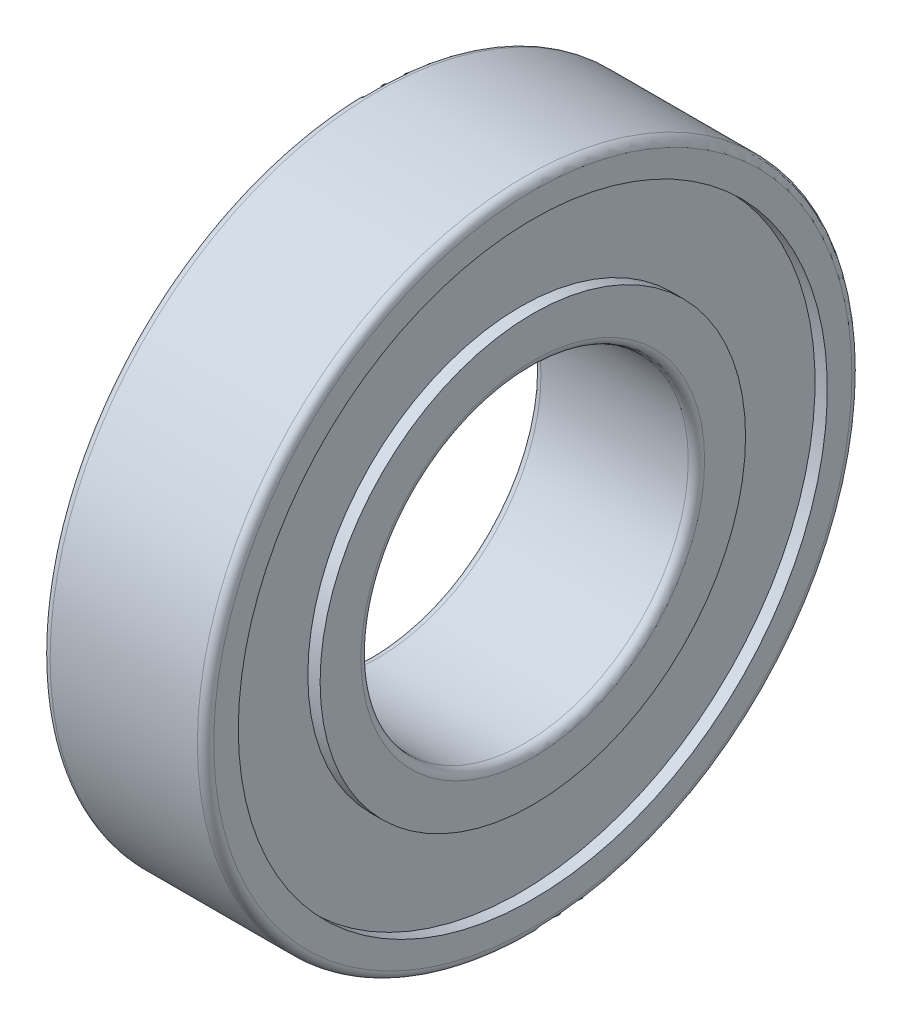
ISO-10303-21;
HEADER;
FILE_DESCRIPTION(('STEP AP214'),'2;1');
FILE_NAME('part.step','',(''),(''),'','','');
FILE_SCHEMA(('AUTOMOTIVE_DESIGN { 1 0 10303 214 1 1 1 1 }'));
ENDSEC;
DATA;
#1=APPLICATION_CONTEXT('core data for automotive mechanical design processes');
#2=APPLICATION_PROTOCOL_DEFINITION('international standard','automotive_design',2000,#1);
#3=PRODUCT_CONTEXT('',#1,'mechanical');
#4=PRODUCT('Part','Part','',(#3));
#5=PRODUCT_RELATED_PRODUCT_CATEGORY('part','',(#4));
#6=PRODUCT_DEFINITION_FORMATION('','',#4);
#7=PRODUCT_DEFINITION_CONTEXT('part definition',#1,'design');
#8=PRODUCT_DEFINITION('design','',#6,#7);
#9=PRODUCT_DEFINITION_SHAPE('','',#8);
#10=(LENGTH_UNIT() NAMED_UNIT(*) SI_UNIT(.MILLI.,.METRE.));
#11=(NAMED_UNIT(*) PLANE_ANGLE_UNIT() SI_UNIT($,.RADIAN.));
#12=(NAMED_UNIT(*) SI_UNIT($,.STERADIAN.) SOLID_ANGLE_UNIT());
#13=UNCERTAINTY_MEASURE_WITH_UNIT(LENGTH_MEASURE(1.E-05),#10,'distance_accuracy_value','');
#14=(GEOMETRIC_REPRESENTATION_CONTEXT(3) GLOBAL_UNCERTAINTY_ASSIGNED_CONTEXT((#13)) GLOBAL_UNIT_ASSIGNED_CONTEXT((#10,
#11,#12)) REPRESENTATION_CONTEXT('',''));
#15=CARTESIAN_POINT('',(0.,0.,0.));
#16=DIRECTION('',(0.,0.,1.));
#17=DIRECTION('',(1.,0.,0.));
#18=AXIS2_PLACEMENT_3D('',#15,#16,#17);
#19=CARTESIAN_POINT('',(6.,0.,0.));
#20=DIRECTION('',(-1.,0.,0.));
#21=DIRECTION('',(0.,0.,1.));
#22=AXIS2_PLACEMENT_3D('',#19,#20,#21);
#23=CYLINDRICAL_SURFACE('',#22,6.);
#24=CARTESIAN_POINT('',(0.3,0.,0.));
#25=DIRECTION('',(1.,0.,0.));
#26=DIRECTION('',(0.,0.,-1.));
#27=AXIS2_PLACEMENT_3D('',#24,#25,#26);
#28=CIRCLE('',#27,6.);
#29=CARTESIAN_POINT('',(0.3,0.,-6.));
#30=VERTEX_POINT('',#29);
#31=EDGE_CURVE('E160',#30,#30,#28,.T.);
#32=ORIENTED_EDGE('',*,*,#31,.F.);
#33=EDGE_LOOP('',(#32));
#34=FACE_BOUND('',#33,.T.);
#35=CARTESIAN_POINT('',(5.7,0.,0.));
#36=DIRECTION('',(1.,0.,0.));
#37=DIRECTION('',(0.,0.,-1.));
#38=AXIS2_PLACEMENT_3D('',#35,#36,#37);
#39=CIRCLE('',#38,6.);
#40=CARTESIAN_POINT('',(5.7,0.,-6.));
#41=VERTEX_POINT('',#40);
#42=EDGE_CURVE('E139',#41,#41,#39,.F.);
#43=ORIENTED_EDGE('',*,*,#42,.F.);
#44=EDGE_LOOP('',(#43));
#45=FACE_BOUND('',#44,.T.);
#46=ADVANCED_FACE('F14',(#34,#45),#23,.F.);
#47=CARTESIAN_POINT('',(0.300000000000002,0.,0.));
#48=DIRECTION('',(1.,0.,0.));
#49=DIRECTION('',(0.,0.,-1.));
#50=AXIS2_PLACEMENT_3D('',#47,#48,#49);
#51=TOROIDAL_SURFACE('',#50,6.3,0.3);
#52=CARTESIAN_POINT('',(0.,0.,0.));
#53=DIRECTION('',(-1.,0.,0.));
#54=DIRECTION('',(0.,0.,-1.));
#55=AXIS2_PLACEMENT_3D('',#52,#53,#54);
#56=CIRCLE('',#55,6.3);
#57=CARTESIAN_POINT('',(0.,0.,-6.3));
#58=VERTEX_POINT('',#57);
#59=EDGE_CURVE('E128',#58,#58,#56,.F.);
#60=ORIENTED_EDGE('',*,*,#59,.F.);
#61=EDGE_LOOP('',(#60));
#62=FACE_BOUND('',#61,.T.);
#63=ORIENTED_EDGE('',*,*,#31,.T.);
#64=EDGE_LOOP('',(#63));
#65=FACE_BOUND('',#64,.T.);
#66=ADVANCED_FACE('F144',(#62,#65),#51,.T.);
#67=CARTESIAN_POINT('',(5.7,0.,0.));
#68=DIRECTION('',(1.,0.,0.));
#69=DIRECTION('',(0.,0.,-1.));
#70=AXIS2_PLACEMENT_3D('',#67,#68,#69);
#71=TOROIDAL_SURFACE('',#70,6.3,0.3);
#72=ORIENTED_EDGE('',*,*,#42,.T.);
#73=EDGE_LOOP('',(#72));
#74=FACE_BOUND('',#73,.T.);
#75=CARTESIAN_POINT('',(6.,0.,0.));
#76=DIRECTION('',(1.,0.,0.));
#77=DIRECTION('',(0.,0.,-1.));
#78=AXIS2_PLACEMENT_3D('',#75,#76,#77);
#79=CIRCLE('',#78,6.3);
#80=CARTESIAN_POINT('',(6.,0.,-6.3));
#81=VERTEX_POINT('',#80);
#82=EDGE_CURVE('E196',#81,#81,#79,.F.);
#83=ORIENTED_EDGE('',*,*,#82,.F.);
#84=EDGE_LOOP('',(#83));
#85=FACE_BOUND('',#84,.T.);
#86=ADVANCED_FACE('F141',(#74,#85),#71,.T.);
#87=CARTESIAN_POINT('',(0.,7.8,0.));
#88=DIRECTION('',(-1.,0.,0.));
#89=DIRECTION('',(0.,0.,1.));
#90=AXIS2_PLACEMENT_3D('',#87,#88,#89);
#91=PLANE('',#90);
#92=CARTESIAN_POINT('',(0.,0.,0.));
#93=DIRECTION('',(-1.,0.,0.));
#94=DIRECTION('',(0.,0.,1.));
#95=AXIS2_PLACEMENT_3D('',#92,#93,#94);
#96=CIRCLE('',#95,7.8);
#97=CARTESIAN_POINT('',(0.,0.,7.8));
#98=VERTEX_POINT('',#97);
#99=EDGE_CURVE('E17',#98,#98,#96,.F.);
#100=ORIENTED_EDGE('',*,*,#99,.F.);
#101=EDGE_LOOP('',(#100));
#102=FACE_BOUND('',#101,.T.);
#103=ORIENTED_EDGE('',*,*,#59,.T.);
#104=EDGE_LOOP('',(#103));
#105=FACE_BOUND('',#104,.T.);
#106=ADVANCED_FACE('F109',(#102,#105),#91,.T.);
#107=CARTESIAN_POINT('',(6.,6.3,0.));
#108=DIRECTION('',(1.,0.,0.));
#109=DIRECTION('',(0.,0.,-1.));
#110=AXIS2_PLACEMENT_3D('',#107,#108,#109);
#111=PLANE('',#110);
#112=ORIENTED_EDGE('',*,*,#82,.T.);
#113=EDGE_LOOP('',(#112));
#114=FACE_BOUND('',#113,.T.);
#115=CARTESIAN_POINT('',(6.,0.,0.));
#116=DIRECTION('',(-1.,0.,0.));
#117=DIRECTION('',(0.,0.,1.));
#118=AXIS2_PLACEMENT_3D('',#115,#116,#117);
#119=CIRCLE('',#118,7.8);
#120=CARTESIAN_POINT('',(6.,0.,7.8));
#121=VERTEX_POINT('',#120);
#122=EDGE_CURVE('E192',#121,#121,#119,.T.);
#123=ORIENTED_EDGE('',*,*,#122,.F.);
#124=EDGE_LOOP('',(#123));
#125=FACE_BOUND('',#124,.T.);
#126=ADVANCED_FACE('F104',(#114,#125),#111,.T.);
#127=CARTESIAN_POINT('',(6.,0.,0.));
#128=DIRECTION('',(-1.,0.,0.));
#129=DIRECTION('',(0.,0.,1.));
#130=AXIS2_PLACEMENT_3D('',#127,#128,#129);
#131=CYLINDRICAL_SURFACE('',#130,7.8);
#132=CARTESIAN_POINT('',(0.45,0.,0.));
#133=DIRECTION('',(-1.,0.,0.));
#134=DIRECTION('',(0.,0.,1.));
#135=AXIS2_PLACEMENT_3D('',#132,#133,#134);
#136=CIRCLE('',#135,7.8);
#137=CARTESIAN_POINT('',(0.45,0.,7.8));
#138=VERTEX_POINT('',#137);
#139=EDGE_CURVE('E190',#138,#138,#136,.F.);
#140=ORIENTED_EDGE('',*,*,#139,.F.);
#141=EDGE_LOOP('',(#140));
#142=FACE_BOUND('',#141,.T.);
#143=ORIENTED_EDGE('',*,*,#99,.T.);
#144=EDGE_LOOP('',(#143));
#145=FACE_BOUND('',#144,.T.);
#146=ADVANCED_FACE('F100',(#142,#145),#131,.T.);
#147=CARTESIAN_POINT('',(6.,0.,0.));
#148=DIRECTION('',(-1.,0.,0.));
#149=DIRECTION('',(0.,0.,1.));
#150=AXIS2_PLACEMENT_3D('',#147,#148,#149);
#151=CYLINDRICAL_SURFACE('',#150,7.8);
#152=ORIENTED_EDGE('',*,*,#122,.T.);
#153=EDGE_LOOP('',(#152));
#154=FACE_BOUND('',#153,.T.);
#155=CARTESIAN_POINT('',(5.55,0.,0.));
#156=DIRECTION('',(-1.,0.,0.));
#157=DIRECTION('',(0.,0.,1.));
#158=AXIS2_PLACEMENT_3D('',#155,#156,#157);
#159=CIRCLE('',#158,7.8);
#160=CARTESIAN_POINT('',(5.55,0.,7.8));
#161=VERTEX_POINT('',#160);
#162=EDGE_CURVE('E187',#161,#161,#159,.T.);
#163=ORIENTED_EDGE('',*,*,#162,.F.);
#164=EDGE_LOOP('',(#163));
#165=FACE_BOUND('',#164,.T.);
#166=ADVANCED_FACE('F96',(#154,#165),#151,.T.);
#167=CARTESIAN_POINT('',(0.45,10.8,0.));
#168=DIRECTION('',(-1.,0.,0.));
#169=DIRECTION('',(0.,0.,1.));
#170=AXIS2_PLACEMENT_3D('',#167,#168,#169);
#171=PLANE('',#170);
#172=CARTESIAN_POINT('',(0.45,0.,0.));
#173=DIRECTION('',(-1.,0.,0.));
#174=DIRECTION('',(0.,0.,1.));
#175=AXIS2_PLACEMENT_3D('',#172,#173,#174);
#176=CIRCLE('',#175,10.8);
#177=CARTESIAN_POINT('',(0.45,0.,10.8));
#178=VERTEX_POINT('',#177);
#179=EDGE_CURVE('E184',#178,#178,#176,.T.);
#180=ORIENTED_EDGE('',*,*,#179,.T.);
#181=EDGE_LOOP('',(#180));
#182=FACE_BOUND('',#181,.T.);
#183=ORIENTED_EDGE('',*,*,#139,.T.);
#184=EDGE_LOOP('',(#183));
#185=FACE_BOUND('',#184,.T.);
#186=ADVANCED_FACE('F92',(#182,#185),#171,.T.);
#187=CARTESIAN_POINT('',(5.55,7.8,0.));
#188=DIRECTION('',(1.,0.,0.));
#189=DIRECTION('',(0.,0.,-1.));
#190=AXIS2_PLACEMENT_3D('',#187,#188,#189);
#191=PLANE('',#190);
#192=ORIENTED_EDGE('',*,*,#162,.T.);
#193=EDGE_LOOP('',(#192));
#194=FACE_BOUND('',#193,.T.);
#195=CARTESIAN_POINT('',(5.55,0.,0.));
#196=DIRECTION('',(-1.,0.,0.));
#197=DIRECTION('',(0.,0.,1.));
#198=AXIS2_PLACEMENT_3D('',#195,#196,#197);
#199=CIRCLE('',#198,10.8);
#200=CARTESIAN_POINT('',(5.55,0.,10.8));
#201=VERTEX_POINT('',#200);
#202=EDGE_CURVE('E181',#201,#201,#199,.F.);
#203=ORIENTED_EDGE('',*,*,#202,.T.);
#204=EDGE_LOOP('',(#203));
#205=FACE_BOUND('',#204,.T.);
#206=ADVANCED_FACE('F88',(#194,#205),#191,.T.);
#207=CARTESIAN_POINT('',(6.,0.,0.));
#208=DIRECTION('',(-1.,0.,0.));
#209=DIRECTION('',(0.,0.,1.));
#210=AXIS2_PLACEMENT_3D('',#207,#208,#209);
#211=CYLINDRICAL_SURFACE('',#210,10.8);
#212=CARTESIAN_POINT('',(0.,0.,0.));
#213=DIRECTION('',(-1.,0.,0.));
#214=DIRECTION('',(0.,0.,1.));
#215=AXIS2_PLACEMENT_3D('',#212,#213,#214);
#216=CIRCLE('',#215,10.8);
#217=CARTESIAN_POINT('',(0.,0.,10.8));
#218=VERTEX_POINT('',#217);
#219=EDGE_CURVE('E178',#218,#218,#216,.F.);
#220=ORIENTED_EDGE('',*,*,#219,.F.);
#221=EDGE_LOOP('',(#220));
#222=FACE_BOUND('',#221,.T.);
#223=ORIENTED_EDGE('',*,*,#179,.F.);
#224=EDGE_LOOP('',(#223));
#225=FACE_BOUND('',#224,.T.);
#226=ADVANCED_FACE('F84',(#222,#225),#211,.F.);
#227=CARTESIAN_POINT('',(6.,0.,0.));
#228=DIRECTION('',(-1.,0.,0.));
#229=DIRECTION('',(0.,0.,1.));
#230=AXIS2_PLACEMENT_3D('',#227,#228,#229);
#231=CYLINDRICAL_SURFACE('',#230,10.8);
#232=ORIENTED_EDGE('',*,*,#202,.F.);
#233=EDGE_LOOP('',(#232));
#234=FACE_BOUND('',#233,.T.);
#235=CARTESIAN_POINT('',(6.,0.,0.));
#236=DIRECTION('',(-1.,0.,0.));
#237=DIRECTION('',(0.,0.,1.));
#238=AXIS2_PLACEMENT_3D('',#235,#236,#237);
#239=CIRCLE('',#238,10.8);
#240=CARTESIAN_POINT('',(6.,0.,10.8));
#241=VERTEX_POINT('',#240);
#242=EDGE_CURVE('E170',#241,#241,#239,.T.);
#243=ORIENTED_EDGE('',*,*,#242,.F.);
#244=EDGE_LOOP('',(#243));
#245=FACE_BOUND('',#244,.T.);
#246=ADVANCED_FACE('F80',(#234,#245),#231,.F.);
#247=CARTESIAN_POINT('',(0.,11.7,0.));
#248=DIRECTION('',(-1.,0.,0.));
#249=DIRECTION('',(0.,0.,1.));
#250=AXIS2_PLACEMENT_3D('',#247,#248,#249);
#251=PLANE('',#250);
#252=CARTESIAN_POINT('',(0.,0.,0.));
#253=DIRECTION('',(1.,0.,0.));
#254=DIRECTION('',(0.,0.,-1.));
#255=AXIS2_PLACEMENT_3D('',#252,#253,#254);
#256=CIRCLE('',#255,11.7);
#257=CARTESIAN_POINT('',(0.,0.,-11.7));
#258=VERTEX_POINT('',#257);
#259=EDGE_CURVE('E64',#258,#258,#256,.T.);
#260=ORIENTED_EDGE('',*,*,#259,.F.);
#261=EDGE_LOOP('',(#260));
#262=FACE_BOUND('',#261,.T.);
#263=ORIENTED_EDGE('',*,*,#219,.T.);
#264=EDGE_LOOP('',(#263));
#265=FACE_BOUND('',#264,.T.);
#266=ADVANCED_FACE('F70',(#262,#265),#251,.T.);
#267=CARTESIAN_POINT('',(6.,10.8,0.));
#268=DIRECTION('',(1.,0.,0.));
#269=DIRECTION('',(0.,0.,-1.));
#270=AXIS2_PLACEMENT_3D('',#267,#268,#269);
#271=PLANE('',#270);
#272=ORIENTED_EDGE('',*,*,#242,.T.);
#273=EDGE_LOOP('',(#272));
#274=FACE_BOUND('',#273,.T.);
#275=CARTESIAN_POINT('',(6.,0.,0.));
#276=DIRECTION('',(-1.,0.,0.));
#277=DIRECTION('',(0.,0.,-1.));
#278=AXIS2_PLACEMENT_3D('',#275,#276,#277);
#279=CIRCLE('',#278,11.7);
#280=CARTESIAN_POINT('',(6.,0.,-11.7));
#281=VERTEX_POINT('',#280);
#282=EDGE_CURVE('E26',#281,#281,#279,.T.);
#283=ORIENTED_EDGE('',*,*,#282,.F.);
#284=EDGE_LOOP('',(#283));
#285=FACE_BOUND('',#284,.T.);
#286=ADVANCED_FACE('F79',(#274,#285),#271,.T.);
#287=CARTESIAN_POINT('',(0.300000000000002,0.,0.));
#288=DIRECTION('',(1.,0.,0.));
#289=DIRECTION('',(0.,0.,-1.));
#290=AXIS2_PLACEMENT_3D('',#287,#288,#289);
#291=TOROIDAL_SURFACE('',#290,11.7,0.3);
#292=CARTESIAN_POINT('',(0.300000000000001,0.,0.));
#293=DIRECTION('',(-1.,0.,0.));
#294=DIRECTION('',(0.,0.,1.));
#295=AXIS2_PLACEMENT_3D('',#292,#293,#294);
#296=CIRCLE('',#295,12.);
#297=CARTESIAN_POINT('',(0.300000000000001,0.,12.));
#298=VERTEX_POINT('',#297);
#299=EDGE_CURVE('E21',#298,#298,#296,.F.);
#300=ORIENTED_EDGE('',*,*,#299,.F.);
#301=EDGE_LOOP('',(#300));
#302=FACE_BOUND('',#301,.T.);
#303=ORIENTED_EDGE('',*,*,#259,.T.);
#304=EDGE_LOOP('',(#303));
#305=FACE_BOUND('',#304,.T.);
#306=ADVANCED_FACE('F44',(#302,#305),#291,.T.);
#307=CARTESIAN_POINT('',(5.7,0.,0.));
#308=DIRECTION('',(1.,0.,0.));
#309=DIRECTION('',(0.,0.,-1.));
#310=AXIS2_PLACEMENT_3D('',#307,#308,#309);
#311=TOROIDAL_SURFACE('',#310,11.7,0.3);
#312=ORIENTED_EDGE('',*,*,#282,.T.);
#313=EDGE_LOOP('',(#312));
#314=FACE_BOUND('',#313,.T.);
#315=CARTESIAN_POINT('',(5.7,0.,0.));
#316=DIRECTION('',(-1.,0.,0.));
#317=DIRECTION('',(0.,0.,1.));
#318=AXIS2_PLACEMENT_3D('',#315,#316,#317);
#319=CIRCLE('',#318,12.);
#320=CARTESIAN_POINT('',(5.7,0.,12.));
#321=VERTEX_POINT('',#320);
#322=EDGE_CURVE('E10',#321,#321,#319,.T.);
#323=ORIENTED_EDGE('',*,*,#322,.F.);
#324=EDGE_LOOP('',(#323));
#325=FACE_BOUND('',#324,.T.);
#326=ADVANCED_FACE('F38',(#314,#325),#311,.T.);
#327=CARTESIAN_POINT('',(6.,0.,0.));
#328=DIRECTION('',(-1.,0.,0.));
#329=DIRECTION('',(0.,0.,1.));
#330=AXIS2_PLACEMENT_3D('',#327,#328,#329);
#331=CYLINDRICAL_SURFACE('',#330,12.);
#332=ORIENTED_EDGE('',*,*,#322,.T.);
#333=EDGE_LOOP('',(#332));
#334=FACE_BOUND('',#333,.T.);
#335=ORIENTED_EDGE('',*,*,#299,.T.);
#336=EDGE_LOOP('',(#335));
#337=FACE_BOUND('',#336,.T.);
#338=ADVANCED_FACE('F43',(#334,#337),#331,.T.);
#339=CLOSED_SHELL('',(#46,#66,#86,#106,#126,#146,#166,#186,#206,#226,#246,#266,#286,#306,#326,#338));
#340=MANIFOLD_SOLID_BREP('B1',#339);
#341=ADVANCED_BREP_SHAPE_REPRESENTATION('',(#18,#340),#14);
#342=SHAPE_DEFINITION_REPRESENTATION(#9,#341);
ENDSEC;
END-ISO-10303-21;
